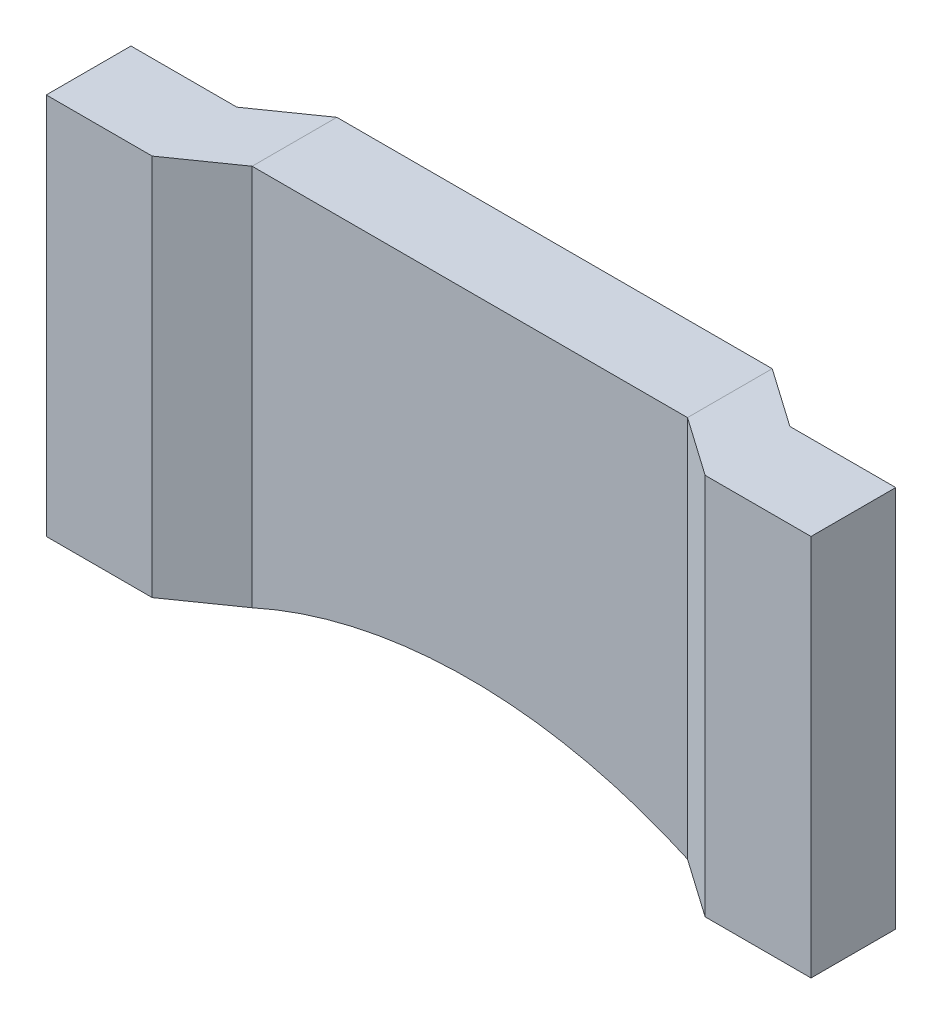
ISO-10303-21;
HEADER;
FILE_DESCRIPTION(('STEP AP214'),'2;1');
FILE_NAME('part.step','',(''),(''),'','','');
FILE_SCHEMA(('AUTOMOTIVE_DESIGN { 1 0 10303 214 1 1 1 1 }'));
ENDSEC;
DATA;
#1=APPLICATION_CONTEXT('core data for automotive mechanical design processes');
#2=APPLICATION_PROTOCOL_DEFINITION('international standard','automotive_design',2000,#1);
#3=PRODUCT_CONTEXT('',#1,'mechanical');
#4=PRODUCT('Part','Part','',(#3));
#5=PRODUCT_RELATED_PRODUCT_CATEGORY('part','',(#4));
#6=PRODUCT_DEFINITION_FORMATION('','',#4);
#7=PRODUCT_DEFINITION_CONTEXT('part definition',#1,'design');
#8=PRODUCT_DEFINITION('design','',#6,#7);
#9=PRODUCT_DEFINITION_SHAPE('','',#8);
#10=(LENGTH_UNIT() NAMED_UNIT(*) SI_UNIT(.MILLI.,.METRE.));
#11=(NAMED_UNIT(*) PLANE_ANGLE_UNIT() SI_UNIT($,.RADIAN.));
#12=(NAMED_UNIT(*) SI_UNIT($,.STERADIAN.) SOLID_ANGLE_UNIT());
#13=UNCERTAINTY_MEASURE_WITH_UNIT(LENGTH_MEASURE(1.E-05),#10,'distance_accuracy_value','');
#14=(GEOMETRIC_REPRESENTATION_CONTEXT(3) GLOBAL_UNCERTAINTY_ASSIGNED_CONTEXT((#13)) GLOBAL_UNIT_ASSIGNED_CONTEXT((#10,
#11,#12)) REPRESENTATION_CONTEXT('',''));
#15=CARTESIAN_POINT('',(0.,0.,0.));
#16=DIRECTION('',(0.,0.,1.));
#17=DIRECTION('',(1.,0.,0.));
#18=AXIS2_PLACEMENT_3D('',#15,#16,#17);
#19=CARTESIAN_POINT('',(-11.4028780659423,-6.60902357657886,-0.547780344865948));
#20=DIRECTION('',(-8.74227765734793E-08,-1.,-4.37114091299597E-08));
#21=DIRECTION('',(-1.,8.74227765734794E-08,0.));
#22=AXIS2_PLACEMENT_3D('',#19,#20,#21);
#23=PLANE('',#22);
#24=DIRECTION('',(0.819152044289011,-4.6540711870944E-08,-0.573576436351015));
#25=VECTOR('',#24,1.);
#26=CARTESIAN_POINT('',(-11.6528039671223,-6.60902354664303,-0.732780344865945));
#27=LINE('',#26,#25);
#28=CARTESIAN_POINT('',(-11.6528039671223,-6.60902354664303,-0.732780344865945));
#29=VERTEX_POINT('',#28);
#30=CARTESIAN_POINT('',(-11.1529521647623,-6.60902357504248,-1.08278034486595));
#31=VERTEX_POINT('',#30);
#32=EDGE_CURVE('P0_E27',#29,#31,#27,.T.);
#33=ORIENTED_EDGE('',*,*,#32,.F.);
#34=DIRECTION('',(1.,-8.74227765734794E-08,0.));
#35=VECTOR('',#34,1.);
#36=CARTESIAN_POINT('',(-12.5528039671223,-6.60902346796254,-0.732780344865939));
#37=LINE('',#36,#35);
#38=CARTESIAN_POINT('',(-12.5528039671223,-6.60902346796254,-0.732780344865939));
#39=VERTEX_POINT('',#38);
#40=EDGE_CURVE('P0_E147',#39,#29,#37,.T.);
#41=ORIENTED_EDGE('',*,*,#40,.F.);
#42=DIRECTION('',(0.,4.37114091299602E-08,-1.));
#43=VECTOR('',#42,1.);
#44=CARTESIAN_POINT('',(-12.5528039671223,-6.60902349943475,-0.0127803448659405));
#45=LINE('',#44,#43);
#46=CARTESIAN_POINT('',(-12.5528039671223,-6.60902349943475,-0.0127803448659405));
#47=VERTEX_POINT('',#46);
#48=EDGE_CURVE('P0_E65',#47,#39,#45,.T.);
#49=ORIENTED_EDGE('',*,*,#48,.F.);
#50=DIRECTION('',(-1.,8.74227765734794E-08,0.));
#51=VECTOR('',#50,1.);
#52=CARTESIAN_POINT('',(-11.6528039671223,-6.60902357811524,-0.0127803448659474));
#53=LINE('',#52,#51);
#54=CARTESIAN_POINT('',(-11.6528039671223,-6.60902357811524,-0.0127803448659474));
#55=VERTEX_POINT('',#54);
#56=EDGE_CURVE('P0_E157',#55,#47,#53,.T.);
#57=ORIENTED_EDGE('',*,*,#56,.F.);
#58=DIRECTION('',(-0.819152044289011,4.6540711870944E-08,0.573576436351015));
#59=VECTOR('',#58,1.);
#60=CARTESIAN_POINT('',(-11.1529521647623,-6.60902360651469,-0.36278034486595));
#61=LINE('',#60,#59);
#62=CARTESIAN_POINT('',(-11.1529521647623,-6.60902360651469,-0.36278034486595));
#63=VERTEX_POINT('',#62);
#64=EDGE_CURVE('P0_E115',#63,#55,#61,.T.);
#65=ORIENTED_EDGE('',*,*,#64,.F.);
#66=DIRECTION('',(0.,-4.37114091299602E-08,1.));
#67=VECTOR('',#66,1.);
#68=CARTESIAN_POINT('',(-11.1529521647623,-6.60902357504248,-1.08278034486595));
#69=LINE('',#68,#67);
#70=EDGE_CURVE('P0_E101',#31,#63,#69,.T.);
#71=ORIENTED_EDGE('',*,*,#70,.F.);
#72=EDGE_LOOP('',(#33,#41,#49,#57,#65,#71));
#73=FACE_BOUND('',#72,.T.);
#74=ADVANCED_FACE('P0_F17',(#73),#23,.F.);
#75=CARTESIAN_POINT('',(-11.4028783500663,-9.85902357657885,-0.547780486928027));
#76=DIRECTION('',(-8.74227765734793E-08,-1.,-4.37114091299597E-08));
#77=DIRECTION('',(-1.,8.74227765734794E-08,0.));
#78=AXIS2_PLACEMENT_3D('',#75,#76,#77);
#79=PLANE('',#78);
#80=DIRECTION('',(0.819152044289011,-4.6540711870944E-08,-0.573576436351015));
#81=VECTOR('',#80,1.);
#82=CARTESIAN_POINT('',(-11.6528042512463,-9.85902354664302,-0.732780486928025));
#83=LINE('',#82,#81);
#84=CARTESIAN_POINT('',(-11.6528042512463,-9.85902354664302,-0.732780486928025));
#85=VERTEX_POINT('',#84);
#86=CARTESIAN_POINT('',(-11.1529524488863,-9.85902357504247,-1.08278048692803));
#87=VERTEX_POINT('',#86);
#88=EDGE_CURVE('P0_E11',#85,#87,#83,.T.);
#89=ORIENTED_EDGE('',*,*,#88,.T.);
#90=DIRECTION('',(0.,-4.37114091299602E-08,1.));
#91=VECTOR('',#90,1.);
#92=CARTESIAN_POINT('',(-11.1529524488863,-9.85902357504247,-1.08278048692803));
#93=LINE('',#92,#91);
#94=CARTESIAN_POINT('',(-11.1529524488863,-9.85902360651468,-0.36278048692803));
#95=VERTEX_POINT('',#94);
#96=EDGE_CURVE('P0_E90',#87,#95,#93,.T.);
#97=ORIENTED_EDGE('',*,*,#96,.T.);
#98=DIRECTION('',(-0.819152044289011,4.6540711870944E-08,0.573576436351015));
#99=VECTOR('',#98,1.);
#100=CARTESIAN_POINT('',(-11.1529524488863,-9.85902360651468,-0.36278048692803));
#101=LINE('',#100,#99);
#102=CARTESIAN_POINT('',(-11.6528042512463,-9.85902357811523,-0.0127804869280274));
#103=VERTEX_POINT('',#102);
#104=EDGE_CURVE('P0_E95',#95,#103,#101,.T.);
#105=ORIENTED_EDGE('',*,*,#104,.T.);
#106=DIRECTION('',(-1.,8.74227765734794E-08,0.));
#107=VECTOR('',#106,1.);
#108=CARTESIAN_POINT('',(-11.6528042512463,-9.85902357811523,-0.0127804869280274));
#109=LINE('',#108,#107);
#110=CARTESIAN_POINT('',(-12.5528042512463,-9.85902349943474,-0.0127804869280205));
#111=VERTEX_POINT('',#110);
#112=EDGE_CURVE('P0_E126',#103,#111,#109,.T.);
#113=ORIENTED_EDGE('',*,*,#112,.T.);
#114=DIRECTION('',(0.,4.37114091299602E-08,-1.));
#115=VECTOR('',#114,1.);
#116=CARTESIAN_POINT('',(-12.5528042512463,-9.85902349943474,-0.0127804869280205));
#117=LINE('',#116,#115);
#118=CARTESIAN_POINT('',(-12.5528042512463,-9.85902346796252,-0.732780486928018));
#119=VERTEX_POINT('',#118);
#120=EDGE_CURVE('P0_E119',#111,#119,#117,.T.);
#121=ORIENTED_EDGE('',*,*,#120,.T.);
#122=DIRECTION('',(1.,-8.74227765734794E-08,0.));
#123=VECTOR('',#122,1.);
#124=CARTESIAN_POINT('',(-12.5528042512463,-9.85902346796252,-0.732780486928018));
#125=LINE('',#124,#123);
#126=EDGE_CURVE('P0_E136',#119,#85,#125,.T.);
#127=ORIENTED_EDGE('',*,*,#126,.T.);
#128=EDGE_LOOP('',(#89,#97,#105,#113,#121,#127));
#129=FACE_BOUND('',#128,.T.);
#130=ADVANCED_FACE('P0_F92',(#129),#79,.T.);
#131=CARTESIAN_POINT('',(-11.6528039671223,-6.60902354664303,-0.732780344865945));
#132=DIRECTION('',(-0.573576436351012,8.59499347904874E-08,-0.819152044289009));
#133=DIRECTION('',(0.819152044289011,-4.6540711870944E-08,-0.573576436351015));
#134=AXIS2_PLACEMENT_3D('',#131,#132,#133);
#135=PLANE('',#134);
#136=ORIENTED_EDGE('',*,*,#32,.T.);
#137=DIRECTION('',(-8.74227765734793E-08,-1.,-4.37114091299597E-08));
#138=VECTOR('',#137,1.);
#139=CARTESIAN_POINT('',(-11.1529521647623,-6.60902357504248,-1.08278034486595));
#140=LINE('',#139,#138);
#141=EDGE_CURVE('P0_E100',#31,#87,#140,.T.);
#142=ORIENTED_EDGE('',*,*,#141,.T.);
#143=ORIENTED_EDGE('',*,*,#88,.F.);
#144=DIRECTION('',(-8.74227765734793E-08,-1.,-4.37114091299597E-08));
#145=VECTOR('',#144,1.);
#146=CARTESIAN_POINT('',(-11.6528039671223,-6.60902354664303,-0.732780344865945));
#147=LINE('',#146,#145);
#148=EDGE_CURVE('P0_E140',#29,#85,#147,.T.);
#149=ORIENTED_EDGE('',*,*,#148,.F.);
#150=EDGE_LOOP('',(#136,#142,#143,#149));
#151=FACE_BOUND('',#150,.T.);
#152=ADVANCED_FACE('P0_F195',(#151),#135,.T.);
#153=CARTESIAN_POINT('',(-11.1529521647623,-6.60902357504248,-1.08278034486595));
#154=DIRECTION('',(1.,-8.74227765734794E-08,0.));
#155=DIRECTION('',(0.,-4.37114091299602E-08,1.));
#156=AXIS2_PLACEMENT_3D('',#153,#154,#155);
#157=PLANE('',#156);
#158=ORIENTED_EDGE('',*,*,#70,.T.);
#159=DIRECTION('',(-8.74227765734793E-08,-1.,-4.37114091299597E-08));
#160=VECTOR('',#159,1.);
#161=CARTESIAN_POINT('',(-11.1529521647623,-6.60902360651469,-0.36278034486595));
#162=LINE('',#161,#160);
#163=EDGE_CURVE('P0_E104',#63,#95,#162,.T.);
#164=ORIENTED_EDGE('',*,*,#163,.T.);
#165=ORIENTED_EDGE('',*,*,#96,.F.);
#166=ORIENTED_EDGE('',*,*,#141,.F.);
#167=EDGE_LOOP('',(#158,#164,#165,#166));
#168=FACE_BOUND('',#167,.T.);
#169=ADVANCED_FACE('P0_F105',(#168),#157,.T.);
#170=CARTESIAN_POINT('',(-11.1529521647623,-6.60902360651469,-0.36278034486595));
#171=DIRECTION('',(0.573576436351012,-8.59499347904874E-08,0.819152044289009));
#172=DIRECTION('',(-0.819152044289011,4.6540711870944E-08,0.573576436351015));
#173=AXIS2_PLACEMENT_3D('',#170,#171,#172);
#174=PLANE('',#173);
#175=ORIENTED_EDGE('',*,*,#64,.T.);
#176=DIRECTION('',(-8.74227765734793E-08,-1.,-4.37114091299597E-08));
#177=VECTOR('',#176,1.);
#178=CARTESIAN_POINT('',(-11.6528039671223,-6.60902357811524,-0.0127803448659474));
#179=LINE('',#178,#177);
#180=EDGE_CURVE('P0_E112',#55,#103,#179,.T.);
#181=ORIENTED_EDGE('',*,*,#180,.T.);
#182=ORIENTED_EDGE('',*,*,#104,.F.);
#183=ORIENTED_EDGE('',*,*,#163,.F.);
#184=EDGE_LOOP('',(#175,#181,#182,#183));
#185=FACE_BOUND('',#184,.T.);
#186=ADVANCED_FACE('P0_F110',(#185),#174,.T.);
#187=CARTESIAN_POINT('',(-12.5528039671223,-6.60902349943475,-0.0127803448659405));
#188=DIRECTION('',(-1.,8.74227765734794E-08,0.));
#189=DIRECTION('',(0.,4.37114091299602E-08,-1.));
#190=AXIS2_PLACEMENT_3D('',#187,#188,#189);
#191=PLANE('',#190);
#192=ORIENTED_EDGE('',*,*,#48,.T.);
#193=DIRECTION('',(-8.74227765734793E-08,-1.,-4.37114091299597E-08));
#194=VECTOR('',#193,1.);
#195=CARTESIAN_POINT('',(-12.5528039671223,-6.60902346796254,-0.732780344865939));
#196=LINE('',#195,#194);
#197=EDGE_CURVE('P0_E139',#39,#119,#196,.T.);
#198=ORIENTED_EDGE('',*,*,#197,.T.);
#199=ORIENTED_EDGE('',*,*,#120,.F.);
#200=DIRECTION('',(-8.74227765734793E-08,-1.,-4.37114091299597E-08));
#201=VECTOR('',#200,1.);
#202=CARTESIAN_POINT('',(-12.5528039671223,-6.60902349943475,-0.0127803448659405));
#203=LINE('',#202,#201);
#204=EDGE_CURVE('P0_E129',#47,#111,#203,.T.);
#205=ORIENTED_EDGE('',*,*,#204,.F.);
#206=EDGE_LOOP('',(#192,#198,#199,#205));
#207=FACE_BOUND('',#206,.T.);
#208=ADVANCED_FACE('P0_F197',(#207),#191,.T.);
#209=CARTESIAN_POINT('',(-12.5528039671223,-6.60902346796254,-0.732780344865939));
#210=DIRECTION('',(0.,4.37114091299602E-08,-1.));
#211=DIRECTION('',(1.,-8.74227765734794E-08,0.));
#212=AXIS2_PLACEMENT_3D('',#209,#210,#211);
#213=PLANE('',#212);
#214=ORIENTED_EDGE('',*,*,#40,.T.);
#215=ORIENTED_EDGE('',*,*,#148,.T.);
#216=ORIENTED_EDGE('',*,*,#126,.F.);
#217=ORIENTED_EDGE('',*,*,#197,.F.);
#218=EDGE_LOOP('',(#214,#215,#216,#217));
#219=FACE_BOUND('',#218,.T.);
#220=ADVANCED_FACE('P0_F194',(#219),#213,.T.);
#221=CARTESIAN_POINT('',(-11.6528039671223,-6.60902357811524,-0.0127803448659474));
#222=DIRECTION('',(0.,-4.37114091299602E-08,1.));
#223=DIRECTION('',(-1.,8.74227765734794E-08,0.));
#224=AXIS2_PLACEMENT_3D('',#221,#222,#223);
#225=PLANE('',#224);
#226=ORIENTED_EDGE('',*,*,#56,.T.);
#227=ORIENTED_EDGE('',*,*,#204,.T.);
#228=ORIENTED_EDGE('',*,*,#112,.F.);
#229=ORIENTED_EDGE('',*,*,#180,.F.);
#230=EDGE_LOOP('',(#226,#227,#228,#229));
#231=FACE_BOUND('',#230,.T.);
#232=ADVANCED_FACE('P0_F268',(#231),#225,.T.);
#233=CLOSED_SHELL('',(#74,#130,#152,#169,#186,#208,#220,#232));
#234=MANIFOLD_SOLID_BREP('P0_B1',#233);
#235=CARTESIAN_POINT('',(-7.20272986830231,-6.60902394376747,-0.54778034486598));
#236=DIRECTION('',(-8.74227765734793E-08,-1.,-4.37114091299597E-08));
#237=DIRECTION('',(-1.,8.74227765734794E-08,0.));
#238=AXIS2_PLACEMENT_3D('',#235,#236,#237);
#239=PLANE('',#238);
#240=DIRECTION('',(0.819152044289016,-9.66843804242312E-08,0.573576436351003));
#241=VECTOR('',#240,1.);
#242=CARTESIAN_POINT('',(-7.45265576948231,-6.60902389853266,-1.08278034486598));
#243=LINE('',#242,#241);
#244=CARTESIAN_POINT('',(-7.45265576948231,-6.60902389853266,-1.08278034486598));
#245=VERTEX_POINT('',#244);
#246=CARTESIAN_POINT('',(-6.95280396712233,-6.60902395753008,-0.732780344865981));
#247=VERTEX_POINT('',#246);
#248=EDGE_CURVE('P1_E96',#245,#247,#243,.T.);
#249=ORIENTED_EDGE('',*,*,#248,.F.);
#250=DIRECTION('',(0.,4.37114091299602E-08,-1.));
#251=VECTOR('',#250,1.);
#252=CARTESIAN_POINT('',(-7.45265576948231,-6.60902393000487,-0.362780344865978));
#253=LINE('',#252,#251);
#254=CARTESIAN_POINT('',(-7.45265576948231,-6.60902393000487,-0.362780344865978));
#255=VERTEX_POINT('',#254);
#256=EDGE_CURVE('P1_E82',#255,#245,#253,.T.);
#257=ORIENTED_EDGE('',*,*,#256,.F.);
#258=DIRECTION('',(-0.819152044289016,9.66843804242312E-08,-0.573576436351003));
#259=VECTOR('',#258,1.);
#260=CARTESIAN_POINT('',(-6.95280396712231,-6.6090239890023,-0.0127803448659834));
#261=LINE('',#260,#259);
#262=CARTESIAN_POINT('',(-6.95280396712231,-6.6090239890023,-0.0127803448659834));
#263=VERTEX_POINT('',#262);
#264=EDGE_CURVE('P1_E27',#263,#255,#261,.T.);
#265=ORIENTED_EDGE('',*,*,#264,.F.);
#266=DIRECTION('',(-1.,8.74227765734794E-08,0.));
#267=VECTOR('',#266,1.);
#268=CARTESIAN_POINT('',(-6.05280396712232,-6.6090240676828,-0.0127803448659904));
#269=LINE('',#268,#267);
#270=CARTESIAN_POINT('',(-6.05280396712232,-6.6090240676828,-0.0127803448659904));
#271=VERTEX_POINT('',#270);
#272=EDGE_CURVE('P1_E136',#271,#263,#269,.T.);
#273=ORIENTED_EDGE('',*,*,#272,.F.);
#274=DIRECTION('',(0.,-4.37114091299602E-08,1.));
#275=VECTOR('',#274,1.);
#276=CARTESIAN_POINT('',(-6.05280396712232,-6.60902403621058,-0.732780344865988));
#277=LINE('',#276,#275);
#278=CARTESIAN_POINT('',(-6.05280396712232,-6.60902403621058,-0.732780344865988));
#279=VERTEX_POINT('',#278);
#280=EDGE_CURVE('P1_E142',#279,#271,#277,.T.);
#281=ORIENTED_EDGE('',*,*,#280,.F.);
#282=DIRECTION('',(1.,-8.74227765734794E-08,0.));
#283=VECTOR('',#282,1.);
#284=CARTESIAN_POINT('',(-6.95280396712233,-6.60902395753008,-0.732780344865981));
#285=LINE('',#284,#283);
#286=EDGE_CURVE('P1_E110',#247,#279,#285,.T.);
#287=ORIENTED_EDGE('',*,*,#286,.F.);
#288=EDGE_LOOP('',(#249,#257,#265,#273,#281,#287));
#289=FACE_BOUND('',#288,.T.);
#290=ADVANCED_FACE('P1_F17',(#289),#239,.F.);
#291=CARTESIAN_POINT('',(-7.20273015242634,-9.85902394376746,-0.547780486928059));
#292=DIRECTION('',(-8.74227765734793E-08,-1.,-4.37114091299597E-08));
#293=DIRECTION('',(-1.,8.74227765734794E-08,0.));
#294=AXIS2_PLACEMENT_3D('',#291,#292,#293);
#295=PLANE('',#294);
#296=DIRECTION('',(-0.819152044289016,9.66843804242312E-08,-0.573576436351003));
#297=VECTOR('',#296,1.);
#298=CARTESIAN_POINT('',(-6.95280425124634,-9.85902398900229,-0.012780486928063));
#299=LINE('',#298,#297);
#300=CARTESIAN_POINT('',(-6.95280425124634,-9.85902398900229,-0.012780486928063));
#301=VERTEX_POINT('',#300);
#302=CARTESIAN_POINT('',(-7.45265605360634,-9.85902393000486,-0.362780486928059));
#303=VERTEX_POINT('',#302);
#304=EDGE_CURVE('P1_E11',#301,#303,#299,.T.);
#305=ORIENTED_EDGE('',*,*,#304,.T.);
#306=DIRECTION('',(0.,4.37114091299602E-08,-1.));
#307=VECTOR('',#306,1.);
#308=CARTESIAN_POINT('',(-7.45265605360634,-9.85902393000486,-0.362780486928059));
#309=LINE('',#308,#307);
#310=CARTESIAN_POINT('',(-7.45265605360634,-9.85902389853265,-1.08278048692806));
#311=VERTEX_POINT('',#310);
#312=EDGE_CURVE('P1_E75',#303,#311,#309,.T.);
#313=ORIENTED_EDGE('',*,*,#312,.T.);
#314=DIRECTION('',(0.819152044289016,-9.66843804242312E-08,0.573576436351003));
#315=VECTOR('',#314,1.);
#316=CARTESIAN_POINT('',(-7.45265605360634,-9.85902389853265,-1.08278048692806));
#317=LINE('',#316,#315);
#318=CARTESIAN_POINT('',(-6.95280425124634,-9.85902395753008,-0.732780486928061));
#319=VERTEX_POINT('',#318);
#320=EDGE_CURVE('P1_E63',#311,#319,#317,.T.);
#321=ORIENTED_EDGE('',*,*,#320,.T.);
#322=DIRECTION('',(1.,-8.74227765734794E-08,0.));
#323=VECTOR('',#322,1.);
#324=CARTESIAN_POINT('',(-6.95280425124634,-9.85902395753008,-0.732780486928061));
#325=LINE('',#324,#323);
#326=CARTESIAN_POINT('',(-6.05280425124635,-9.85902403621057,-0.732780486928068));
#327=VERTEX_POINT('',#326);
#328=EDGE_CURVE('P1_E107',#319,#327,#325,.T.);
#329=ORIENTED_EDGE('',*,*,#328,.T.);
#330=DIRECTION('',(0.,-4.37114091299602E-08,1.));
#331=VECTOR('',#330,1.);
#332=CARTESIAN_POINT('',(-6.05280425124635,-9.85902403621057,-0.732780486928068));
#333=LINE('',#332,#331);
#334=CARTESIAN_POINT('',(-6.05280425124635,-9.85902406768278,-0.0127804869280699));
#335=VERTEX_POINT('',#334);
#336=EDGE_CURVE('P1_E113',#327,#335,#333,.T.);
#337=ORIENTED_EDGE('',*,*,#336,.T.);
#338=DIRECTION('',(-1.,8.74227765734794E-08,0.));
#339=VECTOR('',#338,1.);
#340=CARTESIAN_POINT('',(-6.05280425124635,-9.85902406768278,-0.0127804869280699));
#341=LINE('',#340,#339);
#342=EDGE_CURVE('P1_E100',#335,#301,#341,.T.);
#343=ORIENTED_EDGE('',*,*,#342,.T.);
#344=EDGE_LOOP('',(#305,#313,#321,#329,#337,#343));
#345=FACE_BOUND('',#344,.T.);
#346=ADVANCED_FACE('P1_F77',(#345),#295,.T.);
#347=CARTESIAN_POINT('',(-6.95280396712231,-6.6090239890023,-0.0127803448659834));
#348=DIRECTION('',(-0.573576436351006,1.43373544953665E-08,0.819152044289018));
#349=DIRECTION('',(-0.819152044289016,9.66843804242312E-08,-0.573576436351003));
#350=AXIS2_PLACEMENT_3D('',#347,#348,#349);
#351=PLANE('',#350);
#352=ORIENTED_EDGE('',*,*,#264,.T.);
#353=DIRECTION('',(-8.74227765734793E-08,-1.,-4.37114091299597E-08));
#354=VECTOR('',#353,1.);
#355=CARTESIAN_POINT('',(-7.45265576948231,-6.60902393000487,-0.362780344865978));
#356=LINE('',#355,#354);
#357=EDGE_CURVE('P1_E81',#255,#303,#356,.T.);
#358=ORIENTED_EDGE('',*,*,#357,.T.);
#359=ORIENTED_EDGE('',*,*,#304,.F.);
#360=DIRECTION('',(-8.74227765734793E-08,-1.,-4.37114091299597E-08));
#361=VECTOR('',#360,1.);
#362=CARTESIAN_POINT('',(-6.95280396712231,-6.6090239890023,-0.0127803448659834));
#363=LINE('',#362,#361);
#364=EDGE_CURVE('P1_E123',#263,#301,#363,.T.);
#365=ORIENTED_EDGE('',*,*,#364,.F.);
#366=EDGE_LOOP('',(#352,#358,#359,#365));
#367=FACE_BOUND('',#366,.T.);
#368=ADVANCED_FACE('P1_F190',(#367),#351,.T.);
#369=CARTESIAN_POINT('',(-7.45265576948231,-6.60902393000487,-0.362780344865978));
#370=DIRECTION('',(-1.,8.74227765734794E-08,0.));
#371=DIRECTION('',(0.,4.37114091299602E-08,-1.));
#372=AXIS2_PLACEMENT_3D('',#369,#370,#371);
#373=PLANE('',#372);
#374=ORIENTED_EDGE('',*,*,#256,.T.);
#375=DIRECTION('',(-8.74227765734793E-08,-1.,-4.37114091299597E-08));
#376=VECTOR('',#375,1.);
#377=CARTESIAN_POINT('',(-7.45265576948231,-6.60902389853266,-1.08278034486598));
#378=LINE('',#377,#376);
#379=EDGE_CURVE('P1_E85',#245,#311,#378,.T.);
#380=ORIENTED_EDGE('',*,*,#379,.T.);
#381=ORIENTED_EDGE('',*,*,#312,.F.);
#382=ORIENTED_EDGE('',*,*,#357,.F.);
#383=EDGE_LOOP('',(#374,#380,#381,#382));
#384=FACE_BOUND('',#383,.T.);
#385=ADVANCED_FACE('P1_F86',(#384),#373,.T.);
#386=CARTESIAN_POINT('',(-7.45265576948231,-6.60902389853266,-1.08278034486598));
#387=DIRECTION('',(0.573576436351006,-1.43373544953665E-08,-0.819152044289018));
#388=DIRECTION('',(0.819152044289016,-9.66843804242312E-08,0.573576436351003));
#389=AXIS2_PLACEMENT_3D('',#386,#387,#388);
#390=PLANE('',#389);
#391=ORIENTED_EDGE('',*,*,#248,.T.);
#392=DIRECTION('',(-8.74227765734793E-08,-1.,-4.37114091299597E-08));
#393=VECTOR('',#392,1.);
#394=CARTESIAN_POINT('',(-6.95280396712233,-6.60902395753008,-0.732780344865981));
#395=LINE('',#394,#393);
#396=EDGE_CURVE('P1_E93',#247,#319,#395,.T.);
#397=ORIENTED_EDGE('',*,*,#396,.T.);
#398=ORIENTED_EDGE('',*,*,#320,.F.);
#399=ORIENTED_EDGE('',*,*,#379,.F.);
#400=EDGE_LOOP('',(#391,#397,#398,#399));
#401=FACE_BOUND('',#400,.T.);
#402=ADVANCED_FACE('P1_F91',(#401),#390,.T.);
#403=CARTESIAN_POINT('',(-6.05280396712232,-6.6090240676828,-0.0127803448659904));
#404=DIRECTION('',(0.,-4.37114091299602E-08,1.));
#405=DIRECTION('',(-1.,8.74227765734794E-08,0.));
#406=AXIS2_PLACEMENT_3D('',#403,#404,#405);
#407=PLANE('',#406);
#408=ORIENTED_EDGE('',*,*,#272,.T.);
#409=ORIENTED_EDGE('',*,*,#364,.T.);
#410=ORIENTED_EDGE('',*,*,#342,.F.);
#411=DIRECTION('',(-8.74227765734793E-08,-1.,-4.37114091299597E-08));
#412=VECTOR('',#411,1.);
#413=CARTESIAN_POINT('',(-6.05280396712232,-6.6090240676828,-0.0127803448659904));
#414=LINE('',#413,#412);
#415=EDGE_CURVE('P1_E118',#271,#335,#414,.T.);
#416=ORIENTED_EDGE('',*,*,#415,.F.);
#417=EDGE_LOOP('',(#408,#409,#410,#416));
#418=FACE_BOUND('',#417,.T.);
#419=ADVANCED_FACE('P1_F186',(#418),#407,.T.);
#420=CARTESIAN_POINT('',(-6.95280396712233,-6.60902395753008,-0.732780344865981));
#421=DIRECTION('',(0.,4.37114091299602E-08,-1.));
#422=DIRECTION('',(1.,-8.74227765734794E-08,0.));
#423=AXIS2_PLACEMENT_3D('',#420,#421,#422);
#424=PLANE('',#423);
#425=ORIENTED_EDGE('',*,*,#286,.T.);
#426=DIRECTION('',(-8.74227765734793E-08,-1.,-4.37114091299597E-08));
#427=VECTOR('',#426,1.);
#428=CARTESIAN_POINT('',(-6.05280396712232,-6.60902403621058,-0.732780344865988));
#429=LINE('',#428,#427);
#430=EDGE_CURVE('P1_E117',#279,#327,#429,.T.);
#431=ORIENTED_EDGE('',*,*,#430,.T.);
#432=ORIENTED_EDGE('',*,*,#328,.F.);
#433=ORIENTED_EDGE('',*,*,#396,.F.);
#434=EDGE_LOOP('',(#425,#431,#432,#433));
#435=FACE_BOUND('',#434,.T.);
#436=ADVANCED_FACE('P1_F215',(#435),#424,.T.);
#437=CARTESIAN_POINT('',(-6.05280396712232,-6.60902403621058,-0.732780344865988));
#438=DIRECTION('',(1.,-8.74227765734794E-08,0.));
#439=DIRECTION('',(0.,-4.37114091299602E-08,1.));
#440=AXIS2_PLACEMENT_3D('',#437,#438,#439);
#441=PLANE('',#440);
#442=ORIENTED_EDGE('',*,*,#280,.T.);
#443=ORIENTED_EDGE('',*,*,#415,.T.);
#444=ORIENTED_EDGE('',*,*,#336,.F.);
#445=ORIENTED_EDGE('',*,*,#430,.F.);
#446=EDGE_LOOP('',(#442,#443,#444,#445));
#447=FACE_BOUND('',#446,.T.);
#448=ADVANCED_FACE('P1_F194',(#447),#441,.T.);
#449=CLOSED_SHELL('',(#290,#346,#368,#385,#402,#419,#436,#448));
#450=MANIFOLD_SOLID_BREP('P1_B1',#449);
#451=CARTESIAN_POINT('',(-9.30280396712231,-6.60902375252367,-0.722780344865964));
#452=DIRECTION('',(8.74227765734793E-08,1.,4.37114091299597E-08));
#453=DIRECTION('',(1.,-8.74227765734794E-08,0.));
#454=AXIS2_PLACEMENT_3D('',#451,#452,#453);
#455=PLANE('',#454);
#456=DIRECTION('',(-1.,8.74227765734794E-08,0.));
#457=VECTOR('',#456,1.);
#458=CARTESIAN_POINT('',(-7.45265576948231,-6.60902389853266,-1.08278034486598));
#459=LINE('',#458,#457);
#460=CARTESIAN_POINT('',(-7.45265576948231,-6.60902389853266,-1.08278034486598));
#461=VERTEX_POINT('',#460);
#462=CARTESIAN_POINT('',(-11.1529521647623,-6.60902357504248,-1.08278034486595));
#463=VERTEX_POINT('',#462);
#464=EDGE_CURVE('P2_E11',#461,#463,#459,.T.);
#465=ORIENTED_EDGE('',*,*,#464,.T.);
#466=DIRECTION('',(0.,-4.37114091299602E-08,1.));
#467=VECTOR('',#466,1.);
#468=CARTESIAN_POINT('',(-11.1529521647623,-6.60902357504248,-1.08278034486595));
#469=LINE('',#468,#467);
#470=CARTESIAN_POINT('',(-11.1529521647623,-6.60902360651469,-0.36278034486595));
#471=VERTEX_POINT('',#470);
#472=EDGE_CURVE('P2_E118',#463,#471,#469,.T.);
#473=ORIENTED_EDGE('',*,*,#472,.T.);
#474=DIRECTION('',(1.,-8.74227765734794E-08,0.));
#475=VECTOR('',#474,1.);
#476=CARTESIAN_POINT('',(-11.1529521647623,-6.60902360651469,-0.36278034486595));
#477=LINE('',#476,#475);
#478=CARTESIAN_POINT('',(-7.45265576948231,-6.60902393000487,-0.362780344865978));
#479=VERTEX_POINT('',#478);
#480=EDGE_CURVE('P2_E73',#471,#479,#477,.T.);
#481=ORIENTED_EDGE('',*,*,#480,.T.);
#482=DIRECTION('',(0.,4.37114091299602E-08,-1.));
#483=VECTOR('',#482,1.);
#484=CARTESIAN_POINT('',(-7.45265576948231,-6.60902393000487,-0.362780344865978));
#485=LINE('',#484,#483);
#486=EDGE_CURVE('P2_E124',#479,#461,#485,.T.);
#487=ORIENTED_EDGE('',*,*,#486,.T.);
#488=EDGE_LOOP('',(#465,#473,#481,#487));
#489=FACE_BOUND('',#488,.T.);
#490=ADVANCED_FACE('P2_F17',(#489),#455,.T.);
#491=CARTESIAN_POINT('',(-7.45265605360634,-9.85902389853265,-1.08278048692806));
#492=DIRECTION('',(0.,4.37114091299602E-08,-1.));
#493=DIRECTION('',(-1.,8.74227765734794E-08,0.));
#494=AXIS2_PLACEMENT_3D('',#491,#492,#493);
#495=PLANE('',#494);
#496=CARTESIAN_POINT('',(-9.30280460782727,-13.9378341783265,-1.08278066521859));
#497=DIRECTION('',(0.,-4.37114091299602E-08,1.));
#498=DIRECTION('',(-0.413089114890717,0.910690607812997,3.98075713274905E-08));
#499=AXIS2_PLACEMENT_3D('',#496,#497,#498);
#500=CIRCLE('',#499,4.478810441539);
#501=CARTESIAN_POINT('',(-7.45265605360634,-9.85902389853265,-1.08278048692806));
#502=VERTEX_POINT('',#501);
#503=CARTESIAN_POINT('',(-11.1529524488863,-9.85902357504247,-1.08278048692803));
#504=VERTEX_POINT('',#503);
#505=EDGE_CURVE('P2_E86',#502,#504,#500,.T.);
#506=ORIENTED_EDGE('',*,*,#505,.T.);
#507=DIRECTION('',(8.74227765734793E-08,1.,4.37114091299597E-08));
#508=VECTOR('',#507,1.);
#509=CARTESIAN_POINT('',(-11.1529524488863,-9.85902357504247,-1.08278048692803));
#510=LINE('',#509,#508);
#511=EDGE_CURVE('P2_E27',#504,#463,#510,.T.);
#512=ORIENTED_EDGE('',*,*,#511,.T.);
#513=ORIENTED_EDGE('',*,*,#464,.F.);
#514=DIRECTION('',(8.74227765734793E-08,1.,4.37114091299597E-08));
#515=VECTOR('',#514,1.);
#516=CARTESIAN_POINT('',(-7.45265605360634,-9.85902389853265,-1.08278048692806));
#517=LINE('',#516,#515);
#518=EDGE_CURVE('P2_E77',#502,#461,#517,.T.);
#519=ORIENTED_EDGE('',*,*,#518,.F.);
#520=EDGE_LOOP('',(#506,#512,#513,#519));
#521=FACE_BOUND('',#520,.T.);
#522=ADVANCED_FACE('P2_F141',(#521),#495,.T.);
#523=CARTESIAN_POINT('',(-11.1529524488863,-9.85902357504247,-1.08278048692803));
#524=DIRECTION('',(-1.,8.74227765734794E-08,0.));
#525=DIRECTION('',(0.,-4.37114091299602E-08,1.));
#526=AXIS2_PLACEMENT_3D('',#523,#524,#525);
#527=PLANE('',#526);
#528=DIRECTION('',(0.,-4.37114091299602E-08,1.));
#529=VECTOR('',#528,1.);
#530=CARTESIAN_POINT('',(-11.1529524488863,-9.85902357504247,-1.08278048692803));
#531=LINE('',#530,#529);
#532=CARTESIAN_POINT('',(-11.1529524488863,-9.85902360651468,-0.36278048692803));
#533=VERTEX_POINT('',#532);
#534=EDGE_CURVE('P2_E80',#504,#533,#531,.T.);
#535=ORIENTED_EDGE('',*,*,#534,.T.);
#536=DIRECTION('',(8.74227765734793E-08,1.,4.37114091299597E-08));
#537=VECTOR('',#536,1.);
#538=CARTESIAN_POINT('',(-11.1529524488863,-9.85902360651468,-0.36278048692803));
#539=LINE('',#538,#537);
#540=EDGE_CURVE('P2_E66',#533,#471,#539,.T.);
#541=ORIENTED_EDGE('',*,*,#540,.T.);
#542=ORIENTED_EDGE('',*,*,#472,.F.);
#543=ORIENTED_EDGE('',*,*,#511,.F.);
#544=EDGE_LOOP('',(#535,#541,#542,#543));
#545=FACE_BOUND('',#544,.T.);
#546=ADVANCED_FACE('P2_F81',(#545),#527,.T.);
#547=CARTESIAN_POINT('',(-7.45265605360634,-9.85902393000486,-0.362780486928059));
#548=DIRECTION('',(1.,-8.74227765734794E-08,0.));
#549=DIRECTION('',(0.,4.37114091299602E-08,-1.));
#550=AXIS2_PLACEMENT_3D('',#547,#548,#549);
#551=PLANE('',#550);
#552=DIRECTION('',(0.,4.37114091299602E-08,-1.));
#553=VECTOR('',#552,1.);
#554=CARTESIAN_POINT('',(-7.45265605360634,-9.85902393000486,-0.362780486928059));
#555=LINE('',#554,#553);
#556=CARTESIAN_POINT('',(-7.45265605360634,-9.85902393000486,-0.362780486928059));
#557=VERTEX_POINT('',#556);
#558=EDGE_CURVE('P2_E91',#557,#502,#555,.T.);
#559=ORIENTED_EDGE('',*,*,#558,.T.);
#560=ORIENTED_EDGE('',*,*,#518,.T.);
#561=ORIENTED_EDGE('',*,*,#486,.F.);
#562=DIRECTION('',(8.74227765734793E-08,1.,4.37114091299597E-08));
#563=VECTOR('',#562,1.);
#564=CARTESIAN_POINT('',(-7.45265605360634,-9.85902393000486,-0.362780486928059));
#565=LINE('',#564,#563);
#566=EDGE_CURVE('P2_E101',#557,#479,#565,.T.);
#567=ORIENTED_EDGE('',*,*,#566,.F.);
#568=EDGE_LOOP('',(#559,#560,#561,#567));
#569=FACE_BOUND('',#568,.T.);
#570=ADVANCED_FACE('P2_F139',(#569),#551,.T.);
#571=CARTESIAN_POINT('',(-11.1529524488863,-9.85902360651468,-0.36278048692803));
#572=DIRECTION('',(0.,-4.37114091299602E-08,1.));
#573=DIRECTION('',(1.,-8.74227765734794E-08,0.));
#574=AXIS2_PLACEMENT_3D('',#571,#572,#573);
#575=PLANE('',#574);
#576=CARTESIAN_POINT('',(-9.30280460782727,-13.9378342097988,-0.362780665218596));
#577=DIRECTION('',(0.,4.37114091299602E-08,-1.));
#578=DIRECTION('',(-0.413089114890717,0.910690607812997,3.98075713274905E-08));
#579=AXIS2_PLACEMENT_3D('',#576,#577,#578);
#580=CIRCLE('',#579,4.478810441539);
#581=EDGE_CURVE('P2_E71',#533,#557,#580,.T.);
#582=ORIENTED_EDGE('',*,*,#581,.T.);
#583=ORIENTED_EDGE('',*,*,#566,.T.);
#584=ORIENTED_EDGE('',*,*,#480,.F.);
#585=ORIENTED_EDGE('',*,*,#540,.F.);
#586=EDGE_LOOP('',(#582,#583,#584,#585));
#587=FACE_BOUND('',#586,.T.);
#588=ADVANCED_FACE('P2_F68',(#587),#575,.T.);
#589=CARTESIAN_POINT('',(-9.30280460782727,-13.9378341783265,-1.08278066521859));
#590=DIRECTION('',(0.,-4.37114091299602E-08,1.));
#591=DIRECTION('',(-0.413089114890717,0.910690607812997,3.98075713274905E-08));
#592=AXIS2_PLACEMENT_3D('',#589,#590,#591);
#593=CYLINDRICAL_SURFACE('',#592,4.478810441539);
#594=ORIENTED_EDGE('',*,*,#581,.F.);
#595=ORIENTED_EDGE('',*,*,#534,.F.);
#596=ORIENTED_EDGE('',*,*,#505,.F.);
#597=ORIENTED_EDGE('',*,*,#558,.F.);
#598=EDGE_LOOP('',(#594,#595,#596,#597));
#599=FACE_BOUND('',#598,.T.);
#600=ADVANCED_FACE('P2_F89',(#599),#593,.F.);
#601=CLOSED_SHELL('',(#490,#522,#546,#570,#588,#600));
#602=MANIFOLD_SOLID_BREP('P2_B1',#601);
#603=ADVANCED_BREP_SHAPE_REPRESENTATION('',(#18,#234,#450,#602),#14);
#604=SHAPE_DEFINITION_REPRESENTATION(#9,#603);
ENDSEC;
END-ISO-10303-21;
